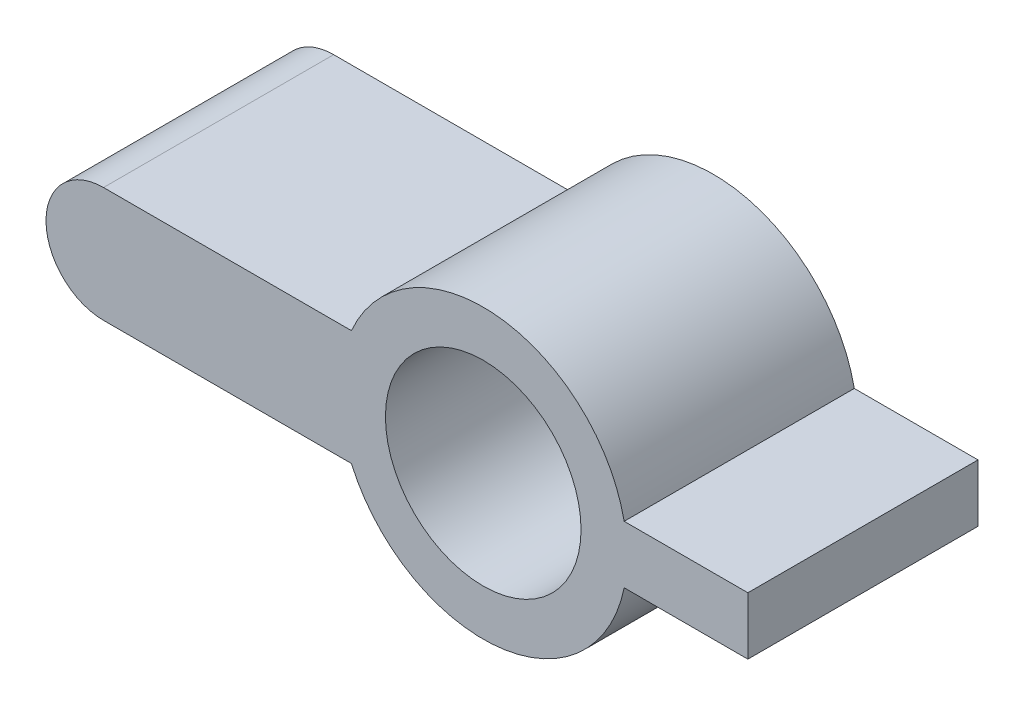
ISO-10303-21;
HEADER;
FILE_DESCRIPTION(('STEP AP214'),'2;1');
FILE_NAME('part.step','',(''),(''),'','','');
FILE_SCHEMA(('AUTOMOTIVE_DESIGN { 1 0 10303 214 1 1 1 1 }'));
ENDSEC;
DATA;
#1=APPLICATION_CONTEXT('core data for automotive mechanical design processes');
#2=APPLICATION_PROTOCOL_DEFINITION('international standard','automotive_design',2000,#1);
#3=PRODUCT_CONTEXT('',#1,'mechanical');
#4=PRODUCT('Part','Part','',(#3));
#5=PRODUCT_RELATED_PRODUCT_CATEGORY('part','',(#4));
#6=PRODUCT_DEFINITION_FORMATION('','',#4);
#7=PRODUCT_DEFINITION_CONTEXT('part definition',#1,'design');
#8=PRODUCT_DEFINITION('design','',#6,#7);
#9=PRODUCT_DEFINITION_SHAPE('','',#8);
#10=(LENGTH_UNIT() NAMED_UNIT(*) SI_UNIT(.MILLI.,.METRE.));
#11=(NAMED_UNIT(*) PLANE_ANGLE_UNIT() SI_UNIT($,.RADIAN.));
#12=(NAMED_UNIT(*) SI_UNIT($,.STERADIAN.) SOLID_ANGLE_UNIT());
#13=UNCERTAINTY_MEASURE_WITH_UNIT(LENGTH_MEASURE(1.E-05),#10,'distance_accuracy_value','');
#14=(GEOMETRIC_REPRESENTATION_CONTEXT(3) GLOBAL_UNCERTAINTY_ASSIGNED_CONTEXT((#13)) GLOBAL_UNIT_ASSIGNED_CONTEXT((#10,
#11,#12)) REPRESENTATION_CONTEXT('',''));
#15=CARTESIAN_POINT('',(0.,0.,0.));
#16=DIRECTION('',(0.,0.,1.));
#17=DIRECTION('',(1.,0.,0.));
#18=AXIS2_PLACEMENT_3D('',#15,#16,#17);
#19=CARTESIAN_POINT('',(-1.15,0.25,0.));
#20=DIRECTION('',(0.,0.,-1.));
#21=DIRECTION('',(-1.,0.,0.));
#22=AXIS2_PLACEMENT_3D('',#19,#20,#21);
#23=PLANE('',#22);
#24=CARTESIAN_POINT('',(-1.15,0.125,0.));
#25=DIRECTION('',(0.,0.,1.));
#26=DIRECTION('',(1.,0.,0.));
#27=AXIS2_PLACEMENT_3D('',#24,#25,#26);
#28=CIRCLE('',#27,0.425);
#29=CARTESIAN_POINT('',(-0.725,0.125,0.));
#30=VERTEX_POINT('',#29);
#31=EDGE_CURVE('E222',#30,#30,#28,.T.);
#32=ORIENTED_EDGE('',*,*,#31,.F.);
#33=EDGE_LOOP('',(#32));
#34=FACE_BOUND('',#33,.T.);
#35=CARTESIAN_POINT('',(-2.8,0.125,0.));
#36=DIRECTION('',(0.,0.,-1.));
#37=DIRECTION('',(-1.,0.,0.));
#38=AXIS2_PLACEMENT_3D('',#35,#36,#37);
#39=CIRCLE('',#38,0.25);
#40=CARTESIAN_POINT('',(-2.8,0.375,0.));
#41=VERTEX_POINT('',#40);
#42=CARTESIAN_POINT('',(-3.05,0.125,0.));
#43=VERTEX_POINT('',#42);
#44=EDGE_CURVE('E201',#41,#43,#39,.F.);
#45=ORIENTED_EDGE('',*,*,#44,.T.);
#46=CARTESIAN_POINT('',(-2.8,0.125,0.));
#47=DIRECTION('',(0.,0.,-1.));
#48=DIRECTION('',(-1.,0.,0.));
#49=AXIS2_PLACEMENT_3D('',#46,#47,#48);
#50=CIRCLE('',#49,0.25);
#51=CARTESIAN_POINT('',(-2.8,-0.125,0.));
#52=VERTEX_POINT('',#51);
#53=EDGE_CURVE('E12',#43,#52,#50,.F.);
#54=ORIENTED_EDGE('',*,*,#53,.T.);
#55=DIRECTION('',(1.,0.,0.));
#56=VECTOR('',#55,1.);
#57=CARTESIAN_POINT('',(-3.05,-0.125,0.));
#58=LINE('',#57,#56);
#59=CARTESIAN_POINT('',(-1.72282196186948,-0.125,0.));
#60=VERTEX_POINT('',#59);
#61=EDGE_CURVE('E158',#52,#60,#58,.T.);
#62=ORIENTED_EDGE('',*,*,#61,.T.);
#63=CARTESIAN_POINT('',(-1.15,0.125,0.));
#64=DIRECTION('',(0.,0.,-1.));
#65=DIRECTION('',(-1.,0.,0.));
#66=AXIS2_PLACEMENT_3D('',#63,#64,#65);
#67=CIRCLE('',#66,0.625000000000001);
#68=CARTESIAN_POINT('',(-0.537627564304205,0.,0.));
#69=VERTEX_POINT('',#68);
#70=EDGE_CURVE('E139',#69,#60,#67,.T.);
#71=ORIENTED_EDGE('',*,*,#70,.F.);
#72=DIRECTION('',(1.,0.,0.));
#73=VECTOR('',#72,1.);
#74=CARTESIAN_POINT('',(-1.15,0.,0.));
#75=LINE('',#74,#73);
#76=CARTESIAN_POINT('',(0.,0.,0.));
#77=VERTEX_POINT('',#76);
#78=EDGE_CURVE('E128',#69,#77,#75,.T.);
#79=ORIENTED_EDGE('',*,*,#78,.T.);
#80=DIRECTION('',(0.,-1.,0.));
#81=VECTOR('',#80,1.);
#82=CARTESIAN_POINT('',(0.,0.25,0.));
#83=LINE('',#82,#81);
#84=CARTESIAN_POINT('',(0.,0.25,0.));
#85=VERTEX_POINT('',#84);
#86=EDGE_CURVE('E185',#85,#77,#83,.T.);
#87=ORIENTED_EDGE('',*,*,#86,.F.);
#88=DIRECTION('',(1.,0.,0.));
#89=VECTOR('',#88,1.);
#90=CARTESIAN_POINT('',(-1.15,0.25,0.));
#91=LINE('',#90,#89);
#92=CARTESIAN_POINT('',(-0.537627564304205,0.25,0.));
#93=VERTEX_POINT('',#92);
#94=EDGE_CURVE('E163',#93,#85,#91,.T.);
#95=ORIENTED_EDGE('',*,*,#94,.F.);
#96=CARTESIAN_POINT('',(-1.72282196186948,0.375,0.));
#97=VERTEX_POINT('',#96);
#98=EDGE_CURVE('E147',#97,#93,#67,.T.);
#99=ORIENTED_EDGE('',*,*,#98,.F.);
#100=DIRECTION('',(1.,0.,0.));
#101=VECTOR('',#100,1.);
#102=CARTESIAN_POINT('',(-3.05,0.375,0.));
#103=LINE('',#102,#101);
#104=EDGE_CURVE('E144',#41,#97,#103,.T.);
#105=ORIENTED_EDGE('',*,*,#104,.F.);
#106=EDGE_LOOP('',(#45,#54,#62,#71,#79,#87,#95,#99,#105));
#107=FACE_BOUND('',#106,.T.);
#108=ADVANCED_FACE('F45',(#34,#107),#23,.F.);
#109=CARTESIAN_POINT('',(0.,0.25,-1.));
#110=DIRECTION('',(-1.,0.,0.));
#111=DIRECTION('',(0.,0.,1.));
#112=AXIS2_PLACEMENT_3D('',#109,#110,#111);
#113=PLANE('',#112);
#114=DIRECTION('',(0.,0.,-1.));
#115=VECTOR('',#114,1.);
#116=CARTESIAN_POINT('',(0.,0.,-1.));
#117=LINE('',#116,#115);
#118=CARTESIAN_POINT('',(0.,0.,-1.));
#119=VERTEX_POINT('',#118);
#120=EDGE_CURVE('E176',#77,#119,#117,.T.);
#121=ORIENTED_EDGE('',*,*,#120,.T.);
#122=DIRECTION('',(0.,-1.,0.));
#123=VECTOR('',#122,1.);
#124=CARTESIAN_POINT('',(0.,0.25,-1.));
#125=LINE('',#124,#123);
#126=CARTESIAN_POINT('',(0.,0.25,-1.));
#127=VERTEX_POINT('',#126);
#128=EDGE_CURVE('E173',#127,#119,#125,.T.);
#129=ORIENTED_EDGE('',*,*,#128,.F.);
#130=DIRECTION('',(0.,0.,-1.));
#131=VECTOR('',#130,1.);
#132=CARTESIAN_POINT('',(0.,0.25,-1.));
#133=LINE('',#132,#131);
#134=EDGE_CURVE('E166',#85,#127,#133,.T.);
#135=ORIENTED_EDGE('',*,*,#134,.F.);
#136=ORIENTED_EDGE('',*,*,#86,.T.);
#137=EDGE_LOOP('',(#121,#129,#135,#136));
#138=FACE_BOUND('',#137,.T.);
#139=ADVANCED_FACE('F240',(#138),#113,.F.);
#140=CARTESIAN_POINT('',(-1.15,0.25,-1.));
#141=DIRECTION('',(0.,0.,1.));
#142=DIRECTION('',(1.,0.,0.));
#143=AXIS2_PLACEMENT_3D('',#140,#141,#142);
#144=PLANE('',#143);
#145=CARTESIAN_POINT('',(-1.15,0.125,-1.));
#146=DIRECTION('',(0.,0.,1.));
#147=DIRECTION('',(1.,0.,0.));
#148=AXIS2_PLACEMENT_3D('',#145,#146,#147);
#149=CIRCLE('',#148,0.425);
#150=CARTESIAN_POINT('',(-0.725,0.125,-1.));
#151=VERTEX_POINT('',#150);
#152=EDGE_CURVE('E226',#151,#151,#149,.T.);
#153=ORIENTED_EDGE('',*,*,#152,.T.);
#154=EDGE_LOOP('',(#153));
#155=FACE_BOUND('',#154,.T.);
#156=DIRECTION('',(1.,0.,0.));
#157=VECTOR('',#156,1.);
#158=CARTESIAN_POINT('',(-3.05,-0.125,-1.));
#159=LINE('',#158,#157);
#160=CARTESIAN_POINT('',(-2.8,-0.125,-1.));
#161=VERTEX_POINT('',#160);
#162=CARTESIAN_POINT('',(-1.72282196186948,-0.125,-1.));
#163=VERTEX_POINT('',#162);
#164=EDGE_CURVE('E129',#161,#163,#159,.T.);
#165=ORIENTED_EDGE('',*,*,#164,.F.);
#166=CARTESIAN_POINT('',(-2.8,0.125,-1.));
#167=DIRECTION('',(0.,0.,1.));
#168=DIRECTION('',(1.,0.,0.));
#169=AXIS2_PLACEMENT_3D('',#166,#167,#168);
#170=CIRCLE('',#169,0.25);
#171=CARTESIAN_POINT('',(-3.05,0.125,-1.));
#172=VERTEX_POINT('',#171);
#173=EDGE_CURVE('E54',#161,#172,#170,.F.);
#174=ORIENTED_EDGE('',*,*,#173,.T.);
#175=CARTESIAN_POINT('',(-2.8,0.125,-1.));
#176=DIRECTION('',(0.,0.,1.));
#177=DIRECTION('',(1.,0.,0.));
#178=AXIS2_PLACEMENT_3D('',#175,#176,#177);
#179=CIRCLE('',#178,0.25);
#180=CARTESIAN_POINT('',(-2.8,0.375,-1.));
#181=VERTEX_POINT('',#180);
#182=EDGE_CURVE('E123',#172,#181,#179,.F.);
#183=ORIENTED_EDGE('',*,*,#182,.T.);
#184=DIRECTION('',(1.,0.,0.));
#185=VECTOR('',#184,1.);
#186=CARTESIAN_POINT('',(-3.05,0.375,-1.));
#187=LINE('',#186,#185);
#188=CARTESIAN_POINT('',(-1.72282196186948,0.375,-1.));
#189=VERTEX_POINT('',#188);
#190=EDGE_CURVE('E115',#181,#189,#187,.T.);
#191=ORIENTED_EDGE('',*,*,#190,.T.);
#192=CARTESIAN_POINT('',(-1.15,0.125,-1.));
#193=DIRECTION('',(0.,0.,-1.));
#194=DIRECTION('',(-1.,0.,0.));
#195=AXIS2_PLACEMENT_3D('',#192,#193,#194);
#196=CIRCLE('',#195,0.625000000000001);
#197=CARTESIAN_POINT('',(-0.537627564304205,0.25,-1.));
#198=VERTEX_POINT('',#197);
#199=EDGE_CURVE('E120',#189,#198,#196,.T.);
#200=ORIENTED_EDGE('',*,*,#199,.T.);
#201=DIRECTION('',(-1.,0.,0.));
#202=VECTOR('',#201,1.);
#203=CARTESIAN_POINT('',(-1.15,0.25,-1.));
#204=LINE('',#203,#202);
#205=EDGE_CURVE('E170',#127,#198,#204,.T.);
#206=ORIENTED_EDGE('',*,*,#205,.F.);
#207=ORIENTED_EDGE('',*,*,#128,.T.);
#208=DIRECTION('',(-1.,0.,0.));
#209=VECTOR('',#208,1.);
#210=CARTESIAN_POINT('',(-1.15,0.,-1.));
#211=LINE('',#210,#209);
#212=CARTESIAN_POINT('',(-0.537627564304205,0.,-1.));
#213=VERTEX_POINT('',#212);
#214=EDGE_CURVE('E167',#119,#213,#211,.T.);
#215=ORIENTED_EDGE('',*,*,#214,.T.);
#216=EDGE_CURVE('E140',#213,#163,#196,.T.);
#217=ORIENTED_EDGE('',*,*,#216,.T.);
#218=EDGE_LOOP('',(#165,#174,#183,#191,#200,#206,#207,#215,#217));
#219=FACE_BOUND('',#218,.T.);
#220=ADVANCED_FACE('F118',(#155,#219),#144,.F.);
#221=CARTESIAN_POINT('',(0.,0.25,0.));
#222=DIRECTION('',(0.,1.,0.));
#223=DIRECTION('',(0.,0.,1.));
#224=AXIS2_PLACEMENT_3D('',#221,#222,#223);
#225=PLANE('',#224);
#226=DIRECTION('',(0.,0.,-1.));
#227=VECTOR('',#226,1.);
#228=CARTESIAN_POINT('',(-0.537627564304205,0.25,0.));
#229=LINE('',#228,#227);
#230=EDGE_CURVE('E137',#93,#198,#229,.T.);
#231=ORIENTED_EDGE('',*,*,#230,.F.);
#232=ORIENTED_EDGE('',*,*,#94,.T.);
#233=ORIENTED_EDGE('',*,*,#134,.T.);
#234=ORIENTED_EDGE('',*,*,#205,.T.);
#235=EDGE_LOOP('',(#231,#232,#233,#234));
#236=FACE_BOUND('',#235,.T.);
#237=ADVANCED_FACE('F243',(#236),#225,.T.);
#238=CARTESIAN_POINT('',(0.,0.,0.));
#239=DIRECTION('',(0.,1.,0.));
#240=DIRECTION('',(0.,0.,1.));
#241=AXIS2_PLACEMENT_3D('',#238,#239,#240);
#242=PLANE('',#241);
#243=ORIENTED_EDGE('',*,*,#78,.F.);
#244=DIRECTION('',(0.,0.,-1.));
#245=VECTOR('',#244,1.);
#246=CARTESIAN_POINT('',(-0.537627564304205,0.,0.));
#247=LINE('',#246,#245);
#248=EDGE_CURVE('E146',#69,#213,#247,.T.);
#249=ORIENTED_EDGE('',*,*,#248,.T.);
#250=ORIENTED_EDGE('',*,*,#214,.F.);
#251=ORIENTED_EDGE('',*,*,#120,.F.);
#252=EDGE_LOOP('',(#243,#249,#250,#251));
#253=FACE_BOUND('',#252,.T.);
#254=ADVANCED_FACE('F236',(#253),#242,.F.);
#255=CARTESIAN_POINT('',(-3.05,0.375,0.));
#256=DIRECTION('',(0.,-1.,0.));
#257=DIRECTION('',(0.,0.,-1.));
#258=AXIS2_PLACEMENT_3D('',#255,#256,#257);
#259=PLANE('',#258);
#260=ORIENTED_EDGE('',*,*,#190,.F.);
#261=DIRECTION('',(0.,0.,-1.));
#262=VECTOR('',#261,1.);
#263=CARTESIAN_POINT('',(-2.8,0.375,0.));
#264=LINE('',#263,#262);
#265=EDGE_CURVE('E198',#181,#41,#264,.F.);
#266=ORIENTED_EDGE('',*,*,#265,.T.);
#267=ORIENTED_EDGE('',*,*,#104,.T.);
#268=DIRECTION('',(0.,0.,-1.));
#269=VECTOR('',#268,1.);
#270=CARTESIAN_POINT('',(-1.72282196186948,0.375,0.));
#271=LINE('',#270,#269);
#272=EDGE_CURVE('E134',#97,#189,#271,.T.);
#273=ORIENTED_EDGE('',*,*,#272,.T.);
#274=EDGE_LOOP('',(#260,#266,#267,#273));
#275=FACE_BOUND('',#274,.T.);
#276=ADVANCED_FACE('F142',(#275),#259,.F.);
#277=CARTESIAN_POINT('',(-3.05,-0.125,0.));
#278=DIRECTION('',(0.,-1.,0.));
#279=DIRECTION('',(0.,0.,-1.));
#280=AXIS2_PLACEMENT_3D('',#277,#278,#279);
#281=PLANE('',#280);
#282=ORIENTED_EDGE('',*,*,#61,.F.);
#283=DIRECTION('',(0.,0.,-1.));
#284=VECTOR('',#283,1.);
#285=CARTESIAN_POINT('',(-2.8,-0.125,-1.));
#286=LINE('',#285,#284);
#287=EDGE_CURVE('E204',#52,#161,#286,.T.);
#288=ORIENTED_EDGE('',*,*,#287,.T.);
#289=ORIENTED_EDGE('',*,*,#164,.T.);
#290=DIRECTION('',(0.,0.,-1.));
#291=VECTOR('',#290,1.);
#292=CARTESIAN_POINT('',(-1.72282196186948,-0.125,0.));
#293=LINE('',#292,#291);
#294=EDGE_CURVE('E189',#60,#163,#293,.T.);
#295=ORIENTED_EDGE('',*,*,#294,.F.);
#296=EDGE_LOOP('',(#282,#288,#289,#295));
#297=FACE_BOUND('',#296,.T.);
#298=ADVANCED_FACE('F213',(#297),#281,.T.);
#299=CARTESIAN_POINT('',(-1.15,0.125,0.));
#300=DIRECTION('',(0.,0.,-1.));
#301=DIRECTION('',(-1.,0.,0.));
#302=AXIS2_PLACEMENT_3D('',#299,#300,#301);
#303=CYLINDRICAL_SURFACE('',#302,0.625000000000001);
#304=ORIENTED_EDGE('',*,*,#248,.F.);
#305=ORIENTED_EDGE('',*,*,#70,.T.);
#306=ORIENTED_EDGE('',*,*,#294,.T.);
#307=ORIENTED_EDGE('',*,*,#216,.F.);
#308=EDGE_LOOP('',(#304,#305,#306,#307));
#309=FACE_BOUND('',#308,.T.);
#310=ADVANCED_FACE('F234',(#309),#303,.T.);
#311=ORIENTED_EDGE('',*,*,#98,.T.);
#312=ORIENTED_EDGE('',*,*,#230,.T.);
#313=ORIENTED_EDGE('',*,*,#199,.F.);
#314=ORIENTED_EDGE('',*,*,#272,.F.);
#315=EDGE_LOOP('',(#311,#312,#313,#314));
#316=FACE_BOUND('',#315,.T.);
#317=ADVANCED_FACE('F133',(#316),#303,.T.);
#318=CARTESIAN_POINT('',(-1.15,0.125,-1.));
#319=DIRECTION('',(0.,0.,1.));
#320=DIRECTION('',(1.,0.,0.));
#321=AXIS2_PLACEMENT_3D('',#318,#319,#320);
#322=CYLINDRICAL_SURFACE('',#321,0.425);
#323=ORIENTED_EDGE('',*,*,#152,.F.);
#324=EDGE_LOOP('',(#323));
#325=FACE_BOUND('',#324,.T.);
#326=ORIENTED_EDGE('',*,*,#31,.T.);
#327=EDGE_LOOP('',(#326));
#328=FACE_BOUND('',#327,.T.);
#329=ADVANCED_FACE('F263',(#325,#328),#322,.F.);
#330=CARTESIAN_POINT('',(-2.8,0.125,0.));
#331=DIRECTION('',(0.,0.,-1.));
#332=DIRECTION('',(0.,1.,0.));
#333=AXIS2_PLACEMENT_3D('',#330,#331,#332);
#334=CYLINDRICAL_SURFACE('',#333,0.25);
#335=ORIENTED_EDGE('',*,*,#44,.F.);
#336=ORIENTED_EDGE('',*,*,#265,.F.);
#337=ORIENTED_EDGE('',*,*,#182,.F.);
#338=DIRECTION('',(0.,0.,-1.));
#339=VECTOR('',#338,1.);
#340=CARTESIAN_POINT('',(-3.05,0.125,0.));
#341=LINE('',#340,#339);
#342=EDGE_CURVE('E193',#43,#172,#341,.T.);
#343=ORIENTED_EDGE('',*,*,#342,.F.);
#344=EDGE_LOOP('',(#335,#336,#337,#343));
#345=FACE_BOUND('',#344,.T.);
#346=ADVANCED_FACE('F211',(#345),#334,.T.);
#347=CARTESIAN_POINT('',(-2.8,0.125,0.));
#348=DIRECTION('',(0.,0.,1.));
#349=DIRECTION('',(0.,-1.,0.));
#350=AXIS2_PLACEMENT_3D('',#347,#348,#349);
#351=CYLINDRICAL_SURFACE('',#350,0.25);
#352=ORIENTED_EDGE('',*,*,#53,.F.);
#353=ORIENTED_EDGE('',*,*,#342,.T.);
#354=ORIENTED_EDGE('',*,*,#173,.F.);
#355=ORIENTED_EDGE('',*,*,#287,.F.);
#356=EDGE_LOOP('',(#352,#353,#354,#355));
#357=FACE_BOUND('',#356,.T.);
#358=ADVANCED_FACE('F47',(#357),#351,.T.);
#359=CLOSED_SHELL('',(#108,#139,#220,#237,#254,#276,#298,#310,#317,#329,#346,#358));
#360=MANIFOLD_SOLID_BREP('B2',#359);
#361=ADVANCED_BREP_SHAPE_REPRESENTATION('',(#18,#360),#14);
#362=SHAPE_DEFINITION_REPRESENTATION(#9,#361);
ENDSEC;
END-ISO-10303-21;
